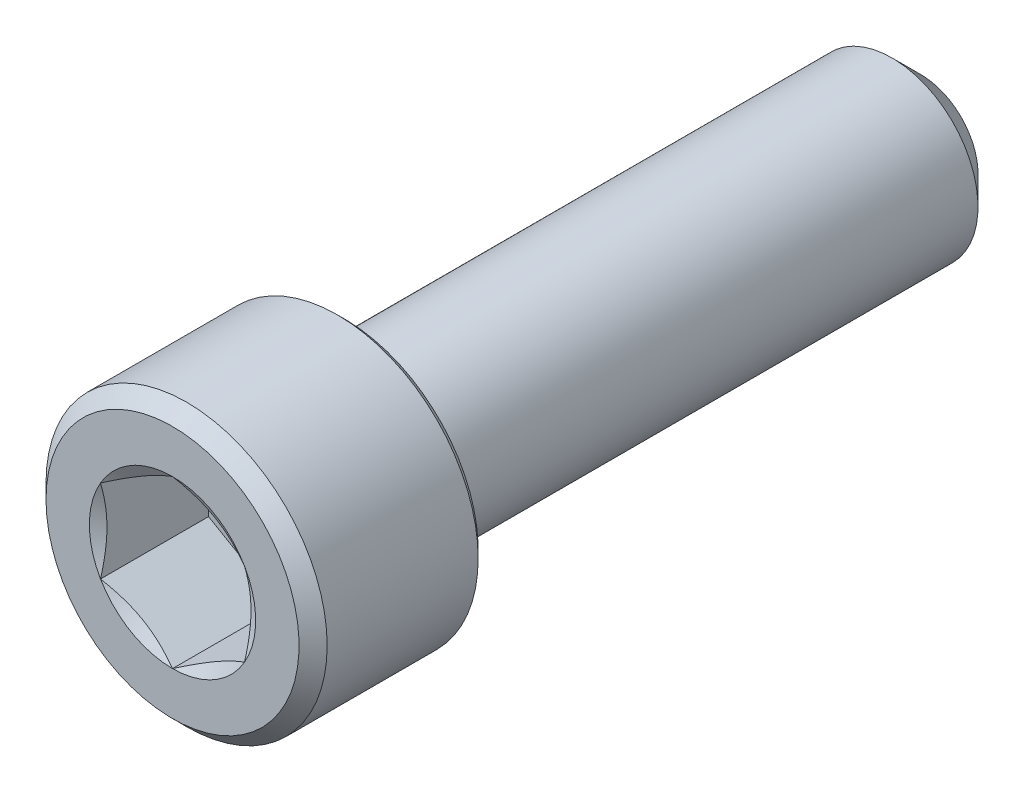
ISO-10303-21;
HEADER;
FILE_DESCRIPTION(('STEP AP214'),'2;1');
FILE_NAME('part.step','',(''),(''),'','','');
FILE_SCHEMA(('AUTOMOTIVE_DESIGN { 1 0 10303 214 1 1 1 1 }'));
ENDSEC;
DATA;
#1=APPLICATION_CONTEXT('core data for automotive mechanical design processes');
#2=APPLICATION_PROTOCOL_DEFINITION('international standard','automotive_design',2000,#1);
#3=PRODUCT_CONTEXT('',#1,'mechanical');
#4=PRODUCT('Part','Part','',(#3));
#5=PRODUCT_RELATED_PRODUCT_CATEGORY('part','',(#4));
#6=PRODUCT_DEFINITION_FORMATION('','',#4);
#7=PRODUCT_DEFINITION_CONTEXT('part definition',#1,'design');
#8=PRODUCT_DEFINITION('design','',#6,#7);
#9=PRODUCT_DEFINITION_SHAPE('','',#8);
#10=(LENGTH_UNIT() NAMED_UNIT(*) SI_UNIT(.MILLI.,.METRE.));
#11=(NAMED_UNIT(*) PLANE_ANGLE_UNIT() SI_UNIT($,.RADIAN.));
#12=(NAMED_UNIT(*) SI_UNIT($,.STERADIAN.) SOLID_ANGLE_UNIT());
#13=UNCERTAINTY_MEASURE_WITH_UNIT(LENGTH_MEASURE(1.E-05),#10,'distance_accuracy_value','');
#14=(GEOMETRIC_REPRESENTATION_CONTEXT(3) GLOBAL_UNCERTAINTY_ASSIGNED_CONTEXT((#13)) GLOBAL_UNIT_ASSIGNED_CONTEXT((#10,
#11,#12)) REPRESENTATION_CONTEXT('',''));
#15=CARTESIAN_POINT('',(0.,0.,0.));
#16=DIRECTION('',(0.,0.,1.));
#17=DIRECTION('',(1.,0.,0.));
#18=AXIS2_PLACEMENT_3D('',#15,#16,#17);
#19=CARTESIAN_POINT('',(0.,2.3241,6.1849));
#20=DIRECTION('',(0.,0.,1.));
#21=DIRECTION('',(1.,0.,0.));
#22=AXIS2_PLACEMENT_3D('',#19,#20,#21);
#23=PLANE('',#22);
#24=CARTESIAN_POINT('',(0.,0.,6.1849));
#25=DIRECTION('',(0.,0.,1.));
#26=DIRECTION('',(1.,0.,0.));
#27=AXIS2_PLACEMENT_3D('',#24,#25,#26);
#28=CIRCLE('',#27,2.09169);
#29=CARTESIAN_POINT('',(-2.09169,0.,6.1849));
#30=VERTEX_POINT('',#29);
#31=EDGE_CURVE('E169',#30,#30,#28,.T.);
#32=ORIENTED_EDGE('',*,*,#31,.T.);
#33=EDGE_LOOP('',(#32));
#34=FACE_BOUND('',#33,.T.);
#35=CARTESIAN_POINT('',(0.,0.,6.1849));
#36=DIRECTION('',(0.,0.,1.));
#37=DIRECTION('',(1.,0.,0.));
#38=AXIS2_PLACEMENT_3D('',#35,#36,#37);
#39=CIRCLE('',#38,1.3748153285078);
#40=CARTESIAN_POINT('',(1.190625,0.687407664253894,6.1849));
#41=VERTEX_POINT('',#40);
#42=CARTESIAN_POINT('',(0.,1.37481532850779,6.1849));
#43=VERTEX_POINT('',#42);
#44=EDGE_CURVE('E87',#41,#43,#39,.T.);
#45=ORIENTED_EDGE('',*,*,#44,.F.);
#46=CARTESIAN_POINT('',(1.190625,-0.6874076642539,6.1849));
#47=VERTEX_POINT('',#46);
#48=EDGE_CURVE('E47',#47,#41,#39,.T.);
#49=ORIENTED_EDGE('',*,*,#48,.F.);
#50=CARTESIAN_POINT('',(0.,-1.3748153285078,6.1849));
#51=VERTEX_POINT('',#50);
#52=EDGE_CURVE('E274',#51,#47,#39,.T.);
#53=ORIENTED_EDGE('',*,*,#52,.F.);
#54=CARTESIAN_POINT('',(-1.190625,-0.6874076642539,6.1849));
#55=VERTEX_POINT('',#54);
#56=EDGE_CURVE('E54',#55,#51,#39,.T.);
#57=ORIENTED_EDGE('',*,*,#56,.F.);
#58=CARTESIAN_POINT('',(-1.190625,0.687407664253898,6.1849));
#59=VERTEX_POINT('',#58);
#60=EDGE_CURVE('E127',#59,#55,#39,.T.);
#61=ORIENTED_EDGE('',*,*,#60,.F.);
#62=EDGE_CURVE('E96',#43,#59,#39,.T.);
#63=ORIENTED_EDGE('',*,*,#62,.F.);
#64=EDGE_LOOP('',(#45,#49,#53,#57,#61,#63));
#65=FACE_BOUND('',#64,.T.);
#66=ADVANCED_FACE('F33',(#34,#65),#23,.T.);
#67=CARTESIAN_POINT('',(0.,0.,-6.1849));
#68=DIRECTION('',(0.,0.,-1.));
#69=DIRECTION('',(-1.,0.,0.));
#70=AXIS2_PLACEMENT_3D('',#67,#68,#69);
#71=CYLINDRICAL_SURFACE('',#70,2.3241);
#72=CARTESIAN_POINT('',(0.,0.,3.456305));
#73=DIRECTION('',(0.,0.,-1.));
#74=DIRECTION('',(-1.,0.,0.));
#75=AXIS2_PLACEMENT_3D('',#72,#73,#74);
#76=CIRCLE('',#75,2.3241);
#77=CARTESIAN_POINT('',(-2.3241,0.,3.456305));
#78=VERTEX_POINT('',#77);
#79=EDGE_CURVE('E11',#78,#78,#76,.F.);
#80=CARTESIAN_POINT('',(0.,0.,5.95249));
#81=DIRECTION('',(0.,0.,1.));
#82=DIRECTION('',(1.,0.,0.));
#83=AXIS2_PLACEMENT_3D('',#80,#81,#82);
#84=CIRCLE('',#83,2.3241);
#85=CARTESIAN_POINT('',(-2.3241,0.,5.95249));
#86=VERTEX_POINT('',#85);
#87=EDGE_CURVE('E106',#86,#86,#84,.F.);
#88=CARTESIAN_POINT('',(-2.3241,0.,3.456305));
#89=CARTESIAN_POINT('',(-2.3241,0.,3.48230692708333));
#90=CARTESIAN_POINT('',(-2.3241,0.,3.50830885416667));
#91=CARTESIAN_POINT('',(-2.3241,0.,3.56031270833333));
#92=CARTESIAN_POINT('',(-2.3241,0.,3.58631463541667));
#93=CARTESIAN_POINT('',(-2.3241,0.,3.63831848958333));
#94=CARTESIAN_POINT('',(-2.3241,0.,3.66432041666667));
#95=CARTESIAN_POINT('',(-2.3241,0.,3.71632427083333));
#96=CARTESIAN_POINT('',(-2.3241,0.,3.74232619791667));
#97=CARTESIAN_POINT('',(-2.3241,0.,3.79433005208333));
#98=CARTESIAN_POINT('',(-2.3241,0.,3.82033197916667));
#99=CARTESIAN_POINT('',(-2.3241,0.,3.87233583333333));
#100=CARTESIAN_POINT('',(-2.3241,0.,3.89833776041667));
#101=CARTESIAN_POINT('',(-2.3241,0.,3.95034161458333));
#102=CARTESIAN_POINT('',(-2.3241,0.,3.97634354166667));
#103=CARTESIAN_POINT('',(-2.3241,0.,4.02834739583333));
#104=CARTESIAN_POINT('',(-2.3241,0.,4.05434932291667));
#105=CARTESIAN_POINT('',(-2.3241,0.,4.10635317708333));
#106=CARTESIAN_POINT('',(-2.3241,0.,4.13235510416667));
#107=CARTESIAN_POINT('',(-2.3241,0.,4.18435895833333));
#108=CARTESIAN_POINT('',(-2.3241,0.,4.21036088541667));
#109=CARTESIAN_POINT('',(-2.3241,0.,4.26236473958333));
#110=CARTESIAN_POINT('',(-2.3241,0.,4.28836666666667));
#111=CARTESIAN_POINT('',(-2.3241,0.,4.34037052083333));
#112=CARTESIAN_POINT('',(-2.3241,0.,4.36637244791667));
#113=CARTESIAN_POINT('',(-2.3241,0.,4.41837630208333));
#114=CARTESIAN_POINT('',(-2.3241,0.,4.44437822916667));
#115=CARTESIAN_POINT('',(-2.3241,0.,4.49638208333333));
#116=CARTESIAN_POINT('',(-2.3241,0.,4.52238401041667));
#117=CARTESIAN_POINT('',(-2.3241,0.,4.57438786458333));
#118=CARTESIAN_POINT('',(-2.3241,0.,4.60038979166667));
#119=CARTESIAN_POINT('',(-2.3241,0.,4.65239364583333));
#120=CARTESIAN_POINT('',(-2.3241,0.,4.67839557291667));
#121=CARTESIAN_POINT('',(-2.3241,0.,4.73039942708333));
#122=CARTESIAN_POINT('',(-2.3241,0.,4.75640135416667));
#123=CARTESIAN_POINT('',(-2.3241,0.,4.80840520833333));
#124=CARTESIAN_POINT('',(-2.3241,0.,4.83440713541667));
#125=CARTESIAN_POINT('',(-2.3241,0.,4.88641098958333));
#126=CARTESIAN_POINT('',(-2.3241,0.,4.91241291666667));
#127=CARTESIAN_POINT('',(-2.3241,0.,4.96441677083333));
#128=CARTESIAN_POINT('',(-2.3241,0.,4.99041869791667));
#129=CARTESIAN_POINT('',(-2.3241,0.,5.04242255208333));
#130=CARTESIAN_POINT('',(-2.3241,0.,5.06842447916667));
#131=CARTESIAN_POINT('',(-2.3241,0.,5.12042833333333));
#132=CARTESIAN_POINT('',(-2.3241,0.,5.14643026041667));
#133=CARTESIAN_POINT('',(-2.3241,0.,5.19843411458333));
#134=CARTESIAN_POINT('',(-2.3241,0.,5.22443604166667));
#135=CARTESIAN_POINT('',(-2.3241,0.,5.27643989583333));
#136=CARTESIAN_POINT('',(-2.3241,0.,5.30244182291667));
#137=CARTESIAN_POINT('',(-2.3241,0.,5.35444567708334));
#138=CARTESIAN_POINT('',(-2.3241,0.,5.38044760416667));
#139=CARTESIAN_POINT('',(-2.3241,0.,5.43245145833333));
#140=CARTESIAN_POINT('',(-2.3241,0.,5.45845338541667));
#141=CARTESIAN_POINT('',(-2.3241,0.,5.51045723958334));
#142=CARTESIAN_POINT('',(-2.3241,0.,5.53645916666667));
#143=CARTESIAN_POINT('',(-2.3241,0.,5.58846302083334));
#144=CARTESIAN_POINT('',(-2.3241,0.,5.61446494791667));
#145=CARTESIAN_POINT('',(-2.3241,0.,5.66646880208333));
#146=CARTESIAN_POINT('',(-2.3241,0.,5.69247072916667));
#147=CARTESIAN_POINT('',(-2.3241,0.,5.74447458333333));
#148=CARTESIAN_POINT('',(-2.3241,0.,5.77047651041667));
#149=CARTESIAN_POINT('',(-2.3241,0.,5.82248036458334));
#150=CARTESIAN_POINT('',(-2.3241,0.,5.84848229166667));
#151=CARTESIAN_POINT('',(-2.3241,0.,5.90048614583333));
#152=CARTESIAN_POINT('',(-2.3241,0.,5.92648807291667));
#153=CARTESIAN_POINT('',(-2.3241,0.,5.95249));
#154=B_SPLINE_CURVE_WITH_KNOTS('',3,(#88,#89,#90,#91,#92,#93,#94,#95,#96,#97,#98,#99,#100,#101,
#102,#103,#104,#105,#106,#107,#108,#109,#110,#111,#112,#113,#114,#115,#116,#117,#118,#119,#120,
#121,#122,#123,#124,#125,#126,#127,#128,#129,#130,#131,#132,#133,#134,#135,#136,#137,#138,#139,
#140,#141,#142,#143,#144,#145,#146,#147,#148,#149,#150,#151,#152,#153),.UNSPECIFIED.,.F.,.F.,(4,
2,2,2,2,2,2,2,2,2,2,2,2,2,2,2,2,2,2,2,2,2,2,2,2,2,2,2,2,2,2,2,4),(0.,0.0780057812499995,
0.156011562500001,0.23401734375,0.312023125,0.390028906250001,0.4680346875,0.54604046875,
0.624046249999999,0.702052031250001,0.7800578125,0.85806359375,0.936069375000001,1.01407515625,
1.0920809375,1.17008671875,1.2480925,1.32609828125,1.4041040625,1.48210984375,1.560115625,
1.63812140625,1.7161271875,1.79413296875,1.87213875,1.95014453125,2.0281503125,2.10615609375,
2.184161875,2.26216765625,2.3401734375,2.41817921875,2.496185),.UNSPECIFIED.);
#155=EDGE_CURVE('BSEAM186',#78,#86,#154,.T.);
#156=ORIENTED_EDGE('',*,*,#79,.T.);
#157=ORIENTED_EDGE('',*,*,#87,.T.);
#158=ORIENTED_EDGE('',*,*,#155,.T.);
#159=ORIENTED_EDGE('',*,*,#155,.F.);
#160=EDGE_LOOP('',(#156,#158,#157,#159));
#161=FACE_BOUND('',#160,.T.);
#162=ADVANCED_FACE('F186',(#161),#71,.T.);
#163=CARTESIAN_POINT('',(0.,2.3241,3.3401));
#164=DIRECTION('',(0.,0.,-1.));
#165=DIRECTION('',(-1.,0.,0.));
#166=AXIS2_PLACEMENT_3D('',#163,#164,#165);
#167=PLANE('',#166);
#168=CARTESIAN_POINT('',(0.,0.,3.3401));
#169=DIRECTION('',(0.,0.,-1.));
#170=DIRECTION('',(-1.,0.,0.));
#171=AXIS2_PLACEMENT_3D('',#168,#169,#170);
#172=CIRCLE('',#171,2.207895);
#173=CARTESIAN_POINT('',(-2.207895,0.,3.3401));
#174=VERTEX_POINT('',#173);
#175=EDGE_CURVE('E41',#174,#174,#172,.T.);
#176=ORIENTED_EDGE('',*,*,#175,.T.);
#177=EDGE_LOOP('',(#176));
#178=FACE_BOUND('',#177,.T.);
#179=CARTESIAN_POINT('',(0.,0.,3.3401));
#180=DIRECTION('',(0.,0.,-1.));
#181=DIRECTION('',(-1.,0.,0.));
#182=AXIS2_PLACEMENT_3D('',#179,#180,#181);
#183=CIRCLE('',#182,1.4224);
#184=CARTESIAN_POINT('',(-1.4224,0.,3.3401));
#185=VERTEX_POINT('',#184);
#186=EDGE_CURVE('E107',#185,#185,#183,.T.);
#187=ORIENTED_EDGE('',*,*,#186,.F.);
#188=EDGE_LOOP('',(#187));
#189=FACE_BOUND('',#188,.T.);
#190=ADVANCED_FACE('F174',(#178,#189),#167,.T.);
#191=CARTESIAN_POINT('',(0.,0.,-6.1849));
#192=DIRECTION('',(0.,0.,-1.));
#193=DIRECTION('',(-1.,0.,0.));
#194=AXIS2_PLACEMENT_3D('',#191,#192,#193);
#195=CYLINDRICAL_SURFACE('',#194,1.4224);
#196=ORIENTED_EDGE('',*,*,#186,.T.);
#197=EDGE_LOOP('',(#196));
#198=FACE_BOUND('',#197,.T.);
#199=CARTESIAN_POINT('',(0.,0.,-5.70865));
#200=DIRECTION('',(0.,0.,-1.));
#201=DIRECTION('',(-1.,0.,0.));
#202=AXIS2_PLACEMENT_3D('',#199,#200,#201);
#203=CIRCLE('',#202,1.4224);
#204=CARTESIAN_POINT('',(-1.4224,0.,-5.70865));
#205=VERTEX_POINT('',#204);
#206=EDGE_CURVE('E215',#205,#205,#203,.T.);
#207=ORIENTED_EDGE('',*,*,#206,.F.);
#208=EDGE_LOOP('',(#207));
#209=FACE_BOUND('',#208,.T.);
#210=ADVANCED_FACE('F197',(#198,#209),#195,.T.);
#211=CARTESIAN_POINT('',(0.,0.,-6.1849));
#212=DIRECTION('',(0.,0.,1.));
#213=DIRECTION('',(1.,0.,0.));
#214=AXIS2_PLACEMENT_3D('',#211,#212,#213);
#215=CONICAL_SURFACE('',#214,0.94615,0.785398163397443);
#216=ORIENTED_EDGE('',*,*,#206,.T.);
#217=EDGE_LOOP('',(#216));
#218=FACE_BOUND('',#217,.T.);
#219=CARTESIAN_POINT('',(0.,0.,-6.1849));
#220=DIRECTION('',(0.,0.,-1.));
#221=DIRECTION('',(-1.,0.,0.));
#222=AXIS2_PLACEMENT_3D('',#219,#220,#221);
#223=CIRCLE('',#222,0.94615);
#224=CARTESIAN_POINT('',(-0.94615,0.,-6.1849));
#225=VERTEX_POINT('',#224);
#226=EDGE_CURVE('E213',#225,#225,#223,.T.);
#227=ORIENTED_EDGE('',*,*,#226,.F.);
#228=EDGE_LOOP('',(#227));
#229=FACE_BOUND('',#228,.T.);
#230=ADVANCED_FACE('F200',(#218,#229),#215,.T.);
#231=CARTESIAN_POINT('',(0.,0.946149999999999,-6.1849));
#232=DIRECTION('',(0.,0.,-1.));
#233=DIRECTION('',(-1.,0.,0.));
#234=AXIS2_PLACEMENT_3D('',#231,#232,#233);
#235=PLANE('',#234);
#236=ORIENTED_EDGE('',*,*,#226,.T.);
#237=EDGE_LOOP('',(#236));
#238=FACE_BOUND('',#237,.T.);
#239=ADVANCED_FACE('F203',(#238),#235,.T.);
#240=CARTESIAN_POINT('',(0.,0.,6.1849));
#241=DIRECTION('',(0.,0.,1.));
#242=DIRECTION('',(1.,0.,0.));
#243=AXIS2_PLACEMENT_3D('',#240,#241,#242);
#244=CONICAL_SURFACE('',#243,1.3748153285078,1.0471975511966);
#245=ORIENTED_EDGE('',*,*,#62,.T.);
#246=CARTESIAN_POINT('',(0.000199999999999628,1.37493079856163,6.18496667506491));
#247=CARTESIAN_POINT('',(-0.0521241335920581,1.34472144594714,6.16751589117194));
#248=CARTESIAN_POINT('',(-0.10489992088635,1.31425133094609,6.15164448025971));
#249=CARTESIAN_POINT('',(-0.211365548014193,1.25278337246439,6.12393948973927));
#250=CARTESIAN_POINT('',(-0.265057280958371,1.22178443599581,6.11211571335686));
#251=CARTESIAN_POINT('',(-0.371775270715524,1.16017077588214,6.09370852677656));
#252=CARTESIAN_POINT('',(-0.424785098452946,1.12956553756824,6.08700263679728));
#253=CARTESIAN_POINT('',(-0.5310544492546,1.0682108992763,6.07899416085589));
#254=CARTESIAN_POINT('',(-0.584313585518837,1.03746172261734,6.07768494640033));
#255=CARTESIAN_POINT('',(-0.683848928687893,0.979994965444803,6.08039449461824));
#256=CARTESIAN_POINT('',(-0.73013996249378,0.953268824615908,6.08374796705388));
#257=CARTESIAN_POINT('',(-0.82242041432083,0.89999068091262,6.0943808803557));
#258=CARTESIAN_POINT('',(-0.868409512663249,0.873438862604836,6.10166396076476));
#259=CARTESIAN_POINT('',(-0.960880551590551,0.820050683387914,6.11987281906172));
#260=CARTESIAN_POINT('',(-1.00735077599472,0.793221086818868,6.13087585831938));
#261=CARTESIAN_POINT('',(-1.09959774541686,0.739962274191063,6.15584909077667));
#262=CARTESIAN_POINT('',(-1.14537567417661,0.713532374698679,6.16981340816491));
#263=CARTESIAN_POINT('',(-1.190825,0.687292194200058,6.18496667506491));
#264=B_SPLINE_CURVE_WITH_KNOTS('',3,(#246,#247,#248,#249,#250,#251,#252,#253,#254,#255,#256,
#257,#258,#259,#260,#261,#262,#263),.UNSPECIFIED.,.F.,.F.,(4,2,2,2,2,2,2,2,4),(0.,
0.188739408275265,0.37793275505226,0.562442610563906,0.746725773280445,0.907244981861693,
1.06791311672804,1.23214725548008,1.39605851764637),.UNSPECIFIED.);
#265=EDGE_CURVE('E101',#43,#59,#264,.T.);
#266=ORIENTED_EDGE('',*,*,#265,.F.);
#267=EDGE_LOOP('',(#245,#266));
#268=FACE_BOUND('',#267,.T.);
#269=ADVANCED_FACE('F102',(#268),#244,.F.);
#270=ORIENTED_EDGE('',*,*,#60,.T.);
#271=CARTESIAN_POINT('',(-1.190625,-1.78015716020704,6.62761639065543));
#272=CARTESIAN_POINT('',(-1.190625,-1.72874189185983,6.6029488309547));
#273=CARTESIAN_POINT('',(-1.190625,-1.67720133899231,6.57853815850608));
#274=CARTESIAN_POINT('',(-1.190625,-1.57380296646994,6.53037458331367));
#275=CARTESIAN_POINT('',(-1.190625,-1.52194509174156,6.50662179894601));
#276=CARTESIAN_POINT('',(-1.190625,-1.41754804002315,6.45978529493314));
#277=CARTESIAN_POINT('',(-1.190625,-1.36500663843256,6.43670650788437));
#278=CARTESIAN_POINT('',(-1.190625,-1.25948270070629,6.39158924420431));
#279=CARTESIAN_POINT('',(-1.190625,-1.2065001876767,6.36955071348109));
#280=CARTESIAN_POINT('',(-1.190625,-1.04398470146779,6.30425143698334));
#281=CARTESIAN_POINT('',(-1.190625,-0.933604354597388,6.26305859990033));
#282=CARTESIAN_POINT('',(-1.190625,-0.710006074690725,6.18975095661509));
#283=CARTESIAN_POINT('',(-1.190625,-0.596796359427707,6.15761258233276));
#284=CARTESIAN_POINT('',(-1.190625,-0.424696051876905,6.12033918761179));
#285=CARTESIAN_POINT('',(-1.190625,-0.367003246478024,6.10974189188063));
#286=CARTESIAN_POINT('',(-1.190625,-0.250970459440642,6.09291523013128));
#287=CARTESIAN_POINT('',(-1.190625,-0.19263052180734,6.08668556893984));
#288=CARTESIAN_POINT('',(-1.190625,-0.076326292549454,6.07917128602073));
#289=CARTESIAN_POINT('',(-1.190625,-0.0183658752538255,6.07782830931197));
#290=CARTESIAN_POINT('',(-1.190625,0.097459106292916,6.0800451833237));
#291=CARTESIAN_POINT('',(-1.190625,0.155323664386656,6.08360533762896));
#292=CARTESIAN_POINT('',(-1.190625,0.298095905598658,6.0981253650142));
#293=CARTESIAN_POINT('',(-1.190625,0.382726930762756,6.11180633734599));
#294=CARTESIAN_POINT('',(-1.190625,0.550343213783401,6.14708560832923));
#295=CARTESIAN_POINT('',(-1.190625,0.633326360497143,6.1686934492585));
#296=CARTESIAN_POINT('',(-1.190625,0.757436785616908,6.20560492392695));
#297=CARTESIAN_POINT('',(-1.190625,0.799205603652767,6.21883085473874));
#298=CARTESIAN_POINT('',(-1.190625,0.882308453068413,6.24650619055065));
#299=CARTESIAN_POINT('',(-1.190625,0.923642737930444,6.2609548320084));
#300=CARTESIAN_POINT('',(-1.190625,1.00593175891306,6.29086575253452));
#301=CARTESIAN_POINT('',(-1.190625,1.04688656247483,6.30632784739001));
#302=CARTESIAN_POINT('',(-1.190625,1.12847345966588,6.33809842729247));
#303=CARTESIAN_POINT('',(-1.190625,1.1691054974264,6.35440705534033));
#304=CARTESIAN_POINT('',(-1.190625,1.27282063071651,6.39708027306631));
#305=CARTESIAN_POINT('',(-1.190625,1.33569634158371,6.42394836206802));
#306=CARTESIAN_POINT('',(-1.190625,1.46087997208419,6.47897974000246));
#307=CARTESIAN_POINT('',(-1.190625,1.52318784876136,6.50714312596451));
#308=CARTESIAN_POINT('',(-1.190625,1.70944892885062,6.59311962148726));
#309=CARTESIAN_POINT('',(-1.190625,1.83271877672913,6.65241025432627));
#310=CARTESIAN_POINT('',(-1.190625,2.07820533773844,6.77347815906779));
#311=CARTESIAN_POINT('',(-1.190625,2.20042056990702,6.83525839830213));
#312=CARTESIAN_POINT('',(-1.190625,2.44401368474694,6.96040744447874));
#313=CARTESIAN_POINT('',(-1.190625,2.56539167137774,7.02377604949749));
#314=CARTESIAN_POINT('',(-1.190625,2.79613899431498,7.14557472773289));
#315=CARTESIAN_POINT('',(-1.190625,2.90556045463821,7.20390639474909));
#316=CARTESIAN_POINT('',(-1.190625,3.12405139947394,7.32123435677135));
#317=CARTESIAN_POINT('',(-1.190625,3.23312087076723,7.3802306763737));
#318=CARTESIAN_POINT('',(-1.190625,3.45071155612091,7.49857057406643));
#319=CARTESIAN_POINT('',(-1.190625,3.55923345906017,7.55791288721241));
#320=CARTESIAN_POINT('',(-1.190625,3.77605786024419,7.67698374464986));
#321=CARTESIAN_POINT('',(-1.190625,3.88436036967376,7.73671226856633));
#322=CARTESIAN_POINT('',(-1.190625,3.99258405604318,7.79658241678741));
#323=B_SPLINE_CURVE_WITH_KNOTS('',3,(#271,#272,#273,#274,#275,#276,#277,#278,#279,#280,#281,
#282,#283,#284,#285,#286,#287,#288,#289,#290,#291,#292,#293,#294,#295,#296,#297,#298,#299,#300,
#301,#302,#303,#304,#305,#306,#307,#308,#309,#310,#311,#312,#313,#314,#315,#316,#317,#318,#319,
#320,#321,#322),.UNSPECIFIED.,.F.,.F.,(4,2,2,2,2,2,2,2,2,2,2,2,2,2,2,2,2,2,2,2,2,2,2,2,2,4),(0.,
0.171081312800698,0.342193211477217,0.514343080996252,0.686483989069504,1.03974142261425,
1.39207067467284,1.56790731618694,1.7437320731725,1.91745017490203,2.09117903313408,
2.34784044559531,2.60481184357443,2.73623569960086,2.86757808297636,2.99889665842932,
3.13023748956819,3.33534372136274,3.54046534255141,3.95077633549906,4.36159174218368,
4.7723551855675,5.14434822317799,5.51635507236915,5.8874157094349,6.25845692794643),.UNSPECIFIED.);
#324=EDGE_CURVE('E95',#59,#55,#323,.F.);
#325=ORIENTED_EDGE('',*,*,#324,.F.);
#326=EDGE_LOOP('',(#270,#325));
#327=FACE_BOUND('',#326,.T.);
#328=ADVANCED_FACE('F210',(#327),#244,.F.);
#329=ORIENTED_EDGE('',*,*,#56,.T.);
#330=CARTESIAN_POINT('',(-1.190825,-0.687292194200062,6.18496667506491));
#331=CARTESIAN_POINT('',(-1.13850086640794,-0.717501546814551,6.16751589117194));
#332=CARTESIAN_POINT('',(-1.08572507911365,-0.747971661815605,6.15164448025971));
#333=CARTESIAN_POINT('',(-0.979259451985808,-0.809439620297307,6.12393948973927));
#334=CARTESIAN_POINT('',(-0.925567719041629,-0.840438556765885,6.11211571335686));
#335=CARTESIAN_POINT('',(-0.818849729284477,-0.902052216879553,6.09370852677656));
#336=CARTESIAN_POINT('',(-0.765839901547055,-0.932657455193449,6.08700263679728));
#337=CARTESIAN_POINT('',(-0.659570550745402,-0.994012093485391,6.07899416085589));
#338=CARTESIAN_POINT('',(-0.606311414481165,-1.02476127014435,6.07768494640033));
#339=CARTESIAN_POINT('',(-0.506776071312108,-1.08222802731689,6.08039449461824));
#340=CARTESIAN_POINT('',(-0.460485037506222,-1.10895416814579,6.08374796705388));
#341=CARTESIAN_POINT('',(-0.368204585679171,-1.16223231184907,6.0943808803557));
#342=CARTESIAN_POINT('',(-0.322215487336752,-1.18878413015686,6.10166396076476));
#343=CARTESIAN_POINT('',(-0.22974444840945,-1.24217230937378,6.11987281906171));
#344=CARTESIAN_POINT('',(-0.183274224005285,-1.26900190594283,6.13087585831937));
#345=CARTESIAN_POINT('',(-0.0910272545831361,-1.32226071857063,6.15584909077667));
#346=CARTESIAN_POINT('',(-0.0452493258233878,-1.34869061806302,6.16981340816491));
#347=CARTESIAN_POINT('',(0.00020000000000012,-1.37493079856164,6.18496667506491));
#348=B_SPLINE_CURVE_WITH_KNOTS('',3,(#330,#331,#332,#333,#334,#335,#336,#337,#338,#339,#340,
#341,#342,#343,#344,#345,#346,#347),.UNSPECIFIED.,.F.,.F.,(4,2,2,2,2,2,2,2,4),(0.,
0.188739408275265,0.377932755052259,0.562442610563904,0.746725773280443,0.907244981861691,
1.06791311672804,1.23214725548008,1.39605851764637),.UNSPECIFIED.);
#349=EDGE_CURVE('E137',#55,#51,#348,.T.);
#350=ORIENTED_EDGE('',*,*,#349,.F.);
#351=EDGE_LOOP('',(#329,#350));
#352=FACE_BOUND('',#351,.T.);
#353=ADVANCED_FACE('F277',(#352),#244,.F.);
#354=ORIENTED_EDGE('',*,*,#52,.T.);
#355=CARTESIAN_POINT('',(-0.000199999999999766,-1.37493079856164,6.18496667506491));
#356=CARTESIAN_POINT('',(0.0521241335920579,-1.34472144594715,6.16751589117194));
#357=CARTESIAN_POINT('',(0.10489992088635,-1.31425133094609,6.15164448025971));
#358=CARTESIAN_POINT('',(0.211365548014192,-1.25278337246439,6.12393948973927));
#359=CARTESIAN_POINT('',(0.265057280958371,-1.22178443599581,6.11211571335686));
#360=CARTESIAN_POINT('',(0.371775270715523,-1.16017077588214,6.09370852677656));
#361=CARTESIAN_POINT('',(0.424785098452945,-1.12956553756825,6.08700263679728));
#362=CARTESIAN_POINT('',(0.531054449254598,-1.06821089927631,6.07899416085589));
#363=CARTESIAN_POINT('',(0.584313585518835,-1.03746172261734,6.07768494640033));
#364=CARTESIAN_POINT('',(0.683848928687891,-0.979994965444807,6.08039449461824));
#365=CARTESIAN_POINT('',(0.730139962493778,-0.953268824615912,6.08374796705388));
#366=CARTESIAN_POINT('',(0.822420414320829,-0.899990680912624,6.0943808803557));
#367=CARTESIAN_POINT('',(0.868409512663248,-0.87343886260484,6.10166396076476));
#368=CARTESIAN_POINT('',(0.96088055159055,-0.820050683387918,6.11987281906172));
#369=CARTESIAN_POINT('',(1.00735077599471,-0.793221086818871,6.13087585831938));
#370=CARTESIAN_POINT('',(1.09959774541686,-0.739962274191066,6.15584909077667));
#371=CARTESIAN_POINT('',(1.14537567417661,-0.713532374698682,6.16981340816491));
#372=CARTESIAN_POINT('',(1.190825,-0.687292194200062,6.18496667506491));
#373=B_SPLINE_CURVE_WITH_KNOTS('',3,(#355,#356,#357,#358,#359,#360,#361,#362,#363,#364,#365,
#366,#367,#368,#369,#370,#371,#372),.UNSPECIFIED.,.F.,.F.,(4,2,2,2,2,2,2,2,4),(0.,
0.188739408275265,0.377932755052259,0.562442610563904,0.746725773280443,0.907244981861691,
1.06791311672804,1.23214725548008,1.39605851764637),.UNSPECIFIED.);
#374=EDGE_CURVE('E251',#51,#47,#373,.T.);
#375=ORIENTED_EDGE('',*,*,#374,.F.);
#376=EDGE_LOOP('',(#354,#375));
#377=FACE_BOUND('',#376,.T.);
#378=ADVANCED_FACE('F276',(#377),#244,.F.);
#379=ORIENTED_EDGE('',*,*,#48,.T.);
#380=CARTESIAN_POINT('',(1.190625,-1.78015716020704,6.62761639065543));
#381=CARTESIAN_POINT('',(1.190625,-1.72874189185983,6.6029488309547));
#382=CARTESIAN_POINT('',(1.190625,-1.67720133899231,6.57853815850608));
#383=CARTESIAN_POINT('',(1.190625,-1.57380296646994,6.53037458331367));
#384=CARTESIAN_POINT('',(1.190625,-1.52194509174156,6.50662179894601));
#385=CARTESIAN_POINT('',(1.190625,-1.41754804002315,6.45978529493314));
#386=CARTESIAN_POINT('',(1.190625,-1.36500663843256,6.43670650788437));
#387=CARTESIAN_POINT('',(1.190625,-1.25948270070629,6.39158924420431));
#388=CARTESIAN_POINT('',(1.190625,-1.2065001876767,6.36955071348109));
#389=CARTESIAN_POINT('',(1.190625,-1.04398470146779,6.30425143698334));
#390=CARTESIAN_POINT('',(1.190625,-0.933604354597387,6.26305859990033));
#391=CARTESIAN_POINT('',(1.190625,-0.710006074690725,6.18975095661509));
#392=CARTESIAN_POINT('',(1.190625,-0.596796359427706,6.15761258233276));
#393=CARTESIAN_POINT('',(1.190625,-0.424696051876905,6.12033918761179));
#394=CARTESIAN_POINT('',(1.190625,-0.367003246478024,6.10974189188064));
#395=CARTESIAN_POINT('',(1.190625,-0.250970459440642,6.09291523013128));
#396=CARTESIAN_POINT('',(1.190625,-0.19263052180734,6.08668556893984));
#397=CARTESIAN_POINT('',(1.190625,-0.0763262925494536,6.07917128602073));
#398=CARTESIAN_POINT('',(1.190625,-0.018365875253825,6.07782830931197));
#399=CARTESIAN_POINT('',(1.190625,0.0974591062929166,6.0800451833237));
#400=CARTESIAN_POINT('',(1.190625,0.155323664386656,6.08360533762896));
#401=CARTESIAN_POINT('',(1.190625,0.298095905598659,6.0981253650142));
#402=CARTESIAN_POINT('',(1.190625,0.382726930762757,6.11180633734599));
#403=CARTESIAN_POINT('',(1.190625,0.550343213783401,6.14708560832923));
#404=CARTESIAN_POINT('',(1.190625,0.633326360497144,6.1686934492585));
#405=CARTESIAN_POINT('',(1.190625,0.757436785616909,6.20560492392695));
#406=CARTESIAN_POINT('',(1.190625,0.799205603652768,6.21883085473874));
#407=CARTESIAN_POINT('',(1.190625,0.882308453068414,6.24650619055065));
#408=CARTESIAN_POINT('',(1.190625,0.923642737930444,6.2609548320084));
#409=CARTESIAN_POINT('',(1.190625,1.00593175891306,6.29086575253452));
#410=CARTESIAN_POINT('',(1.190625,1.04688656247483,6.30632784739001));
#411=CARTESIAN_POINT('',(1.190625,1.12847345966589,6.33809842729247));
#412=CARTESIAN_POINT('',(1.190625,1.1691054974264,6.35440705534033));
#413=CARTESIAN_POINT('',(1.190625,1.27282063071651,6.39708027306631));
#414=CARTESIAN_POINT('',(1.190625,1.33569634158371,6.42394836206802));
#415=CARTESIAN_POINT('',(1.190625,1.46087997208419,6.47897974000246));
#416=CARTESIAN_POINT('',(1.190625,1.52318784876136,6.50714312596451));
#417=CARTESIAN_POINT('',(1.190625,1.70944892885062,6.59311962148726));
#418=CARTESIAN_POINT('',(1.190625,1.83271877672913,6.65241025432627));
#419=CARTESIAN_POINT('',(1.190625,2.07820533773844,6.77347815906779));
#420=CARTESIAN_POINT('',(1.190625,2.20042056990702,6.83525839830213));
#421=CARTESIAN_POINT('',(1.190625,2.44401368474694,6.96040744447874));
#422=CARTESIAN_POINT('',(1.190625,2.56539167137774,7.02377604949749));
#423=CARTESIAN_POINT('',(1.190625,2.79613899431499,7.14557472773289));
#424=CARTESIAN_POINT('',(1.190625,2.90556045463821,7.20390639474909));
#425=CARTESIAN_POINT('',(1.190625,3.12405139947394,7.32123435677135));
#426=CARTESIAN_POINT('',(1.190625,3.23312087076723,7.3802306763737));
#427=CARTESIAN_POINT('',(1.190625,3.45071155612091,7.49857057406643));
#428=CARTESIAN_POINT('',(1.190625,3.55923345906017,7.55791288721241));
#429=CARTESIAN_POINT('',(1.190625,3.77605786024419,7.67698374464985));
#430=CARTESIAN_POINT('',(1.190625,3.88436036967376,7.73671226856633));
#431=CARTESIAN_POINT('',(1.190625,3.99258405604319,7.79658241678741));
#432=B_SPLINE_CURVE_WITH_KNOTS('',3,(#380,#381,#382,#383,#384,#385,#386,#387,#388,#389,#390,
#391,#392,#393,#394,#395,#396,#397,#398,#399,#400,#401,#402,#403,#404,#405,#406,#407,#408,#409,
#410,#411,#412,#413,#414,#415,#416,#417,#418,#419,#420,#421,#422,#423,#424,#425,#426,#427,#428,
#429,#430,#431),.UNSPECIFIED.,.F.,.F.,(4,2,2,2,2,2,2,2,2,2,2,2,2,2,2,2,2,2,2,2,2,2,2,2,2,4),(0.,
0.171081312800697,0.342193211477216,0.514343080996251,0.686483989069503,1.03974142261425,
1.39207067467283,1.56790731618694,1.7437320731725,1.91745017490203,2.09117903313408,
2.34784044559531,2.60481184357443,2.73623569960086,2.86757808297636,2.99889665842932,
3.13023748956819,3.33534372136274,3.5404653425514,3.95077633549906,4.36159174218368,
4.7723551855675,5.14434822317799,5.51635507236915,5.8874157094349,6.25845692794643),.UNSPECIFIED.);
#433=EDGE_CURVE('E117',#47,#41,#432,.T.);
#434=ORIENTED_EDGE('',*,*,#433,.F.);
#435=EDGE_LOOP('',(#379,#434));
#436=FACE_BOUND('',#435,.T.);
#437=ADVANCED_FACE('F287',(#436),#244,.F.);
#438=ORIENTED_EDGE('',*,*,#44,.T.);
#439=CARTESIAN_POINT('',(1.190825,0.687292194200059,6.18496667506491));
#440=CARTESIAN_POINT('',(1.13850086640794,0.717501546814547,6.16751589117194));
#441=CARTESIAN_POINT('',(1.08572507911365,0.747971661815602,6.15164448025971));
#442=CARTESIAN_POINT('',(0.979259451985808,0.809439620297304,6.12393948973927));
#443=CARTESIAN_POINT('',(0.925567719041629,0.840438556765883,6.11211571335686));
#444=CARTESIAN_POINT('',(0.818849729284477,0.90205221687955,6.09370852677656));
#445=CARTESIAN_POINT('',(0.765839901547055,0.932657455193447,6.08700263679728));
#446=CARTESIAN_POINT('',(0.659570550745401,0.994012093485388,6.07899416085589));
#447=CARTESIAN_POINT('',(0.606311414481164,1.02476127014435,6.07768494640033));
#448=CARTESIAN_POINT('',(0.506776071312108,1.08222802731689,6.08039449461824));
#449=CARTESIAN_POINT('',(0.460485037506222,1.10895416814578,6.08374796705388));
#450=CARTESIAN_POINT('',(0.368204585679171,1.16223231184907,6.0943808803557));
#451=CARTESIAN_POINT('',(0.322215487336752,1.18878413015685,6.10166396076476));
#452=CARTESIAN_POINT('',(0.22974444840945,1.24217230937378,6.11987281906172));
#453=CARTESIAN_POINT('',(0.183274224005285,1.26900190594282,6.13087585831938));
#454=CARTESIAN_POINT('',(0.0910272545831359,1.32226071857063,6.15584909077667));
#455=CARTESIAN_POINT('',(0.0452493258233876,1.34869061806301,6.16981340816491));
#456=CARTESIAN_POINT('',(-0.00020000000000037,1.37493079856163,6.18496667506491));
#457=B_SPLINE_CURVE_WITH_KNOTS('',3,(#439,#440,#441,#442,#443,#444,#445,#446,#447,#448,#449,
#450,#451,#452,#453,#454,#455,#456),.UNSPECIFIED.,.F.,.F.,(4,2,2,2,2,2,2,2,4),(0.,
0.188739408275265,0.377932755052259,0.562442610563905,0.746725773280444,0.907244981861692,
1.06791311672804,1.23214725548008,1.39605851764637),.UNSPECIFIED.);
#458=EDGE_CURVE('E91',#41,#43,#457,.T.);
#459=ORIENTED_EDGE('',*,*,#458,.F.);
#460=EDGE_LOOP('',(#438,#459));
#461=FACE_BOUND('',#460,.T.);
#462=ADVANCED_FACE('F89',(#461),#244,.F.);
#463=CARTESIAN_POINT('',(0.,0.,4.3989625));
#464=DIRECTION('',(0.,0.,1.));
#465=DIRECTION('',(1.,0.,0.));
#466=AXIS2_PLACEMENT_3D('',#463,#464,#465);
#467=PLANE('',#466);
#468=DIRECTION('',(-0.866025403784439,0.5,0.));
#469=VECTOR('',#468,1.);
#470=CARTESIAN_POINT('',(1.190625,0.687407664253897,4.3989625));
#471=LINE('',#470,#469);
#472=CARTESIAN_POINT('',(1.190625,0.687407664253897,4.3989625));
#473=VERTEX_POINT('',#472);
#474=CARTESIAN_POINT('',(0.,1.37481532850779,4.3989625));
#475=VERTEX_POINT('',#474);
#476=EDGE_CURVE('E116',#473,#475,#471,.T.);
#477=ORIENTED_EDGE('',*,*,#476,.T.);
#478=DIRECTION('',(-0.866025403784438,-0.5,0.));
#479=VECTOR('',#478,1.);
#480=CARTESIAN_POINT('',(0.,1.37481532850779,4.3989625));
#481=LINE('',#480,#479);
#482=CARTESIAN_POINT('',(-1.190625,0.687407664253896,4.3989625));
#483=VERTEX_POINT('',#482);
#484=EDGE_CURVE('E121',#475,#483,#481,.T.);
#485=ORIENTED_EDGE('',*,*,#484,.T.);
#486=DIRECTION('',(0.,-1.,0.));
#487=VECTOR('',#486,1.);
#488=CARTESIAN_POINT('',(-1.190625,0.687407664253896,4.3989625));
#489=LINE('',#488,#487);
#490=CARTESIAN_POINT('',(-1.190625,-0.6874076642539,4.3989625));
#491=VERTEX_POINT('',#490);
#492=EDGE_CURVE('E237',#483,#491,#489,.T.);
#493=ORIENTED_EDGE('',*,*,#492,.T.);
#494=DIRECTION('',(0.866025403784439,-0.5,0.));
#495=VECTOR('',#494,1.);
#496=CARTESIAN_POINT('',(-1.190625,-0.6874076642539,4.3989625));
#497=LINE('',#496,#495);
#498=CARTESIAN_POINT('',(0.,-1.3748153285078,4.3989625));
#499=VERTEX_POINT('',#498);
#500=EDGE_CURVE('E234',#491,#499,#497,.T.);
#501=ORIENTED_EDGE('',*,*,#500,.T.);
#502=DIRECTION('',(0.866025403784439,0.5,0.));
#503=VECTOR('',#502,1.);
#504=CARTESIAN_POINT('',(0.,-1.3748153285078,4.3989625));
#505=LINE('',#504,#503);
#506=CARTESIAN_POINT('',(1.190625,-0.6874076642539,4.3989625));
#507=VERTEX_POINT('',#506);
#508=EDGE_CURVE('E231',#499,#507,#505,.T.);
#509=ORIENTED_EDGE('',*,*,#508,.T.);
#510=DIRECTION('',(0.,1.,0.));
#511=VECTOR('',#510,1.);
#512=CARTESIAN_POINT('',(1.190625,-0.6874076642539,4.3989625));
#513=LINE('',#512,#511);
#514=EDGE_CURVE('E124',#507,#473,#513,.T.);
#515=ORIENTED_EDGE('',*,*,#514,.T.);
#516=EDGE_LOOP('',(#477,#485,#493,#501,#509,#515));
#517=FACE_BOUND('',#516,.T.);
#518=ADVANCED_FACE('F157',(#517),#467,.T.);
#519=CARTESIAN_POINT('',(0.,1.37481532850779,4.3989625));
#520=DIRECTION('',(-0.5,0.866025403784438,0.));
#521=DIRECTION('',(-0.866025403784439,-0.5,0.));
#522=AXIS2_PLACEMENT_3D('',#519,#520,#521);
#523=PLANE('',#522);
#524=DIRECTION('',(0.,0.,1.));
#525=VECTOR('',#524,1.);
#526=CARTESIAN_POINT('',(0.,1.37481532850779,4.3989625));
#527=LINE('',#526,#525);
#528=EDGE_CURVE('E113',#475,#43,#527,.T.);
#529=ORIENTED_EDGE('',*,*,#528,.T.);
#530=ORIENTED_EDGE('',*,*,#265,.T.);
#531=DIRECTION('',(0.,0.,1.));
#532=VECTOR('',#531,1.);
#533=CARTESIAN_POINT('',(-1.190625,0.687407664253896,4.3989625));
#534=LINE('',#533,#532);
#535=EDGE_CURVE('E123',#483,#59,#534,.T.);
#536=ORIENTED_EDGE('',*,*,#535,.F.);
#537=ORIENTED_EDGE('',*,*,#484,.F.);
#538=EDGE_LOOP('',(#529,#530,#536,#537));
#539=FACE_BOUND('',#538,.T.);
#540=ADVANCED_FACE('F119',(#539),#523,.F.);
#541=CARTESIAN_POINT('',(-1.190625,0.687407664253896,4.3989625));
#542=DIRECTION('',(-1.,0.,0.));
#543=DIRECTION('',(0.,-1.,0.));
#544=AXIS2_PLACEMENT_3D('',#541,#542,#543);
#545=PLANE('',#544);
#546=ORIENTED_EDGE('',*,*,#535,.T.);
#547=ORIENTED_EDGE('',*,*,#324,.T.);
#548=DIRECTION('',(0.,0.,1.));
#549=VECTOR('',#548,1.);
#550=CARTESIAN_POINT('',(-1.190625,-0.6874076642539,4.3989625));
#551=LINE('',#550,#549);
#552=EDGE_CURVE('E222',#491,#55,#551,.T.);
#553=ORIENTED_EDGE('',*,*,#552,.F.);
#554=ORIENTED_EDGE('',*,*,#492,.F.);
#555=EDGE_LOOP('',(#546,#547,#553,#554));
#556=FACE_BOUND('',#555,.T.);
#557=ADVANCED_FACE('F146',(#556),#545,.F.);
#558=CARTESIAN_POINT('',(-1.190625,-0.6874076642539,4.3989625));
#559=DIRECTION('',(-0.5,-0.866025403784439,0.));
#560=DIRECTION('',(0.866025403784439,-0.5,0.));
#561=AXIS2_PLACEMENT_3D('',#558,#559,#560);
#562=PLANE('',#561);
#563=ORIENTED_EDGE('',*,*,#552,.T.);
#564=ORIENTED_EDGE('',*,*,#349,.T.);
#565=DIRECTION('',(0.,0.,1.));
#566=VECTOR('',#565,1.);
#567=CARTESIAN_POINT('',(0.,-1.3748153285078,4.3989625));
#568=LINE('',#567,#566);
#569=EDGE_CURVE('E225',#499,#51,#568,.T.);
#570=ORIENTED_EDGE('',*,*,#569,.F.);
#571=ORIENTED_EDGE('',*,*,#500,.F.);
#572=EDGE_LOOP('',(#563,#564,#570,#571));
#573=FACE_BOUND('',#572,.T.);
#574=ADVANCED_FACE('F150',(#573),#562,.F.);
#575=CARTESIAN_POINT('',(0.,-1.3748153285078,4.3989625));
#576=DIRECTION('',(0.5,-0.866025403784439,0.));
#577=DIRECTION('',(0.866025403784439,0.5,0.));
#578=AXIS2_PLACEMENT_3D('',#575,#576,#577);
#579=PLANE('',#578);
#580=ORIENTED_EDGE('',*,*,#569,.T.);
#581=ORIENTED_EDGE('',*,*,#374,.T.);
#582=DIRECTION('',(0.,0.,1.));
#583=VECTOR('',#582,1.);
#584=CARTESIAN_POINT('',(1.190625,-0.6874076642539,4.3989625));
#585=LINE('',#584,#583);
#586=EDGE_CURVE('E218',#507,#47,#585,.T.);
#587=ORIENTED_EDGE('',*,*,#586,.F.);
#588=ORIENTED_EDGE('',*,*,#508,.F.);
#589=EDGE_LOOP('',(#580,#581,#587,#588));
#590=FACE_BOUND('',#589,.T.);
#591=ADVANCED_FACE('F259',(#590),#579,.F.);
#592=CARTESIAN_POINT('',(1.190625,-0.6874076642539,4.3989625));
#593=DIRECTION('',(1.,0.,0.));
#594=DIRECTION('',(0.,0.,-1.));
#595=AXIS2_PLACEMENT_3D('',#592,#593,#594);
#596=PLANE('',#595);
#597=ORIENTED_EDGE('',*,*,#586,.T.);
#598=ORIENTED_EDGE('',*,*,#433,.T.);
#599=DIRECTION('',(0.,0.,1.));
#600=VECTOR('',#599,1.);
#601=CARTESIAN_POINT('',(1.190625,0.687407664253897,4.3989625));
#602=LINE('',#601,#600);
#603=EDGE_CURVE('E115',#473,#41,#602,.T.);
#604=ORIENTED_EDGE('',*,*,#603,.F.);
#605=ORIENTED_EDGE('',*,*,#514,.F.);
#606=EDGE_LOOP('',(#597,#598,#604,#605));
#607=FACE_BOUND('',#606,.T.);
#608=ADVANCED_FACE('F256',(#607),#596,.F.);
#609=CARTESIAN_POINT('',(1.190625,0.687407664253897,4.3989625));
#610=DIRECTION('',(0.5,0.866025403784439,0.));
#611=DIRECTION('',(-0.866025403784439,0.5,0.));
#612=AXIS2_PLACEMENT_3D('',#609,#610,#611);
#613=PLANE('',#612);
#614=ORIENTED_EDGE('',*,*,#603,.T.);
#615=ORIENTED_EDGE('',*,*,#458,.T.);
#616=ORIENTED_EDGE('',*,*,#528,.F.);
#617=ORIENTED_EDGE('',*,*,#476,.F.);
#618=EDGE_LOOP('',(#614,#615,#616,#617));
#619=FACE_BOUND('',#618,.T.);
#620=ADVANCED_FACE('F111',(#619),#613,.F.);
#621=CARTESIAN_POINT('',(0.,0.,5.95249));
#622=DIRECTION('',(0.,0.,-1.));
#623=DIRECTION('',(-1.,0.,0.));
#624=AXIS2_PLACEMENT_3D('',#621,#622,#623);
#625=CONICAL_SURFACE('',#624,2.3241,0.785398163397456);
#626=CARTESIAN_POINT('',(-2.09169,0.,6.1849));
#627=CARTESIAN_POINT('',(-2.0941109375,0.,6.1824790625));
#628=CARTESIAN_POINT('',(-2.096531875,0.,6.180058125));
#629=CARTESIAN_POINT('',(-2.10137375,0.,6.17521625));
#630=CARTESIAN_POINT('',(-2.1037946875,0.,6.1727953125));
#631=CARTESIAN_POINT('',(-2.1086365625,0.,6.1679534375));
#632=CARTESIAN_POINT('',(-2.1110575,0.,6.1655325));
#633=CARTESIAN_POINT('',(-2.115899375,0.,6.160690625));
#634=CARTESIAN_POINT('',(-2.1183203125,0.,6.1582696875));
#635=CARTESIAN_POINT('',(-2.1231621875,0.,6.1534278125));
#636=CARTESIAN_POINT('',(-2.125583125,0.,6.151006875));
#637=CARTESIAN_POINT('',(-2.130425,0.,6.146165));
#638=CARTESIAN_POINT('',(-2.1328459375,0.,6.1437440625));
#639=CARTESIAN_POINT('',(-2.1376878125,0.,6.1389021875));
#640=CARTESIAN_POINT('',(-2.14010875,0.,6.13648125));
#641=CARTESIAN_POINT('',(-2.144950625,0.,6.131639375));
#642=CARTESIAN_POINT('',(-2.1473715625,0.,6.1292184375));
#643=CARTESIAN_POINT('',(-2.1522134375,0.,6.1243765625));
#644=CARTESIAN_POINT('',(-2.154634375,0.,6.121955625));
#645=CARTESIAN_POINT('',(-2.15947625,0.,6.11711375));
#646=CARTESIAN_POINT('',(-2.1618971875,0.,6.1146928125));
#647=CARTESIAN_POINT('',(-2.1667390625,0.,6.1098509375));
#648=CARTESIAN_POINT('',(-2.16916,0.,6.10743));
#649=CARTESIAN_POINT('',(-2.174001875,0.,6.102588125));
#650=CARTESIAN_POINT('',(-2.1764228125,0.,6.1001671875));
#651=CARTESIAN_POINT('',(-2.1812646875,0.,6.0953253125));
#652=CARTESIAN_POINT('',(-2.183685625,0.,6.092904375));
#653=CARTESIAN_POINT('',(-2.1885275,0.,6.0880625));
#654=CARTESIAN_POINT('',(-2.1909484375,0.,6.0856415625));
#655=CARTESIAN_POINT('',(-2.1957903125,0.,6.0807996875));
#656=CARTESIAN_POINT('',(-2.19821125,0.,6.07837875));
#657=CARTESIAN_POINT('',(-2.203053125,0.,6.073536875));
#658=CARTESIAN_POINT('',(-2.2054740625,0.,6.0711159375));
#659=CARTESIAN_POINT('',(-2.2103159375,0.,6.0662740625));
#660=CARTESIAN_POINT('',(-2.212736875,0.,6.063853125));
#661=CARTESIAN_POINT('',(-2.21757875,0.,6.05901125));
#662=CARTESIAN_POINT('',(-2.2199996875,0.,6.0565903125));
#663=CARTESIAN_POINT('',(-2.2248415625,0.,6.0517484375));
#664=CARTESIAN_POINT('',(-2.2272625,0.,6.0493275));
#665=CARTESIAN_POINT('',(-2.232104375,0.,6.044485625));
#666=CARTESIAN_POINT('',(-2.2345253125,0.,6.0420646875));
#667=CARTESIAN_POINT('',(-2.2393671875,0.,6.0372228125));
#668=CARTESIAN_POINT('',(-2.241788125,0.,6.034801875));
#669=CARTESIAN_POINT('',(-2.24663,0.,6.02996));
#670=CARTESIAN_POINT('',(-2.2490509375,0.,6.0275390625));
#671=CARTESIAN_POINT('',(-2.2538928125,0.,6.0226971875));
#672=CARTESIAN_POINT('',(-2.25631375,0.,6.02027625));
#673=CARTESIAN_POINT('',(-2.261155625,0.,6.015434375));
#674=CARTESIAN_POINT('',(-2.2635765625,0.,6.0130134375));
#675=CARTESIAN_POINT('',(-2.2684184375,0.,6.0081715625));
#676=CARTESIAN_POINT('',(-2.270839375,0.,6.005750625));
#677=CARTESIAN_POINT('',(-2.27568125,0.,6.00090875));
#678=CARTESIAN_POINT('',(-2.2781021875,0.,5.9984878125));
#679=CARTESIAN_POINT('',(-2.2829440625,0.,5.9936459375));
#680=CARTESIAN_POINT('',(-2.285365,0.,5.991225));
#681=CARTESIAN_POINT('',(-2.290206875,0.,5.986383125));
#682=CARTESIAN_POINT('',(-2.2926278125,0.,5.9839621875));
#683=CARTESIAN_POINT('',(-2.2974696875,0.,5.9791203125));
#684=CARTESIAN_POINT('',(-2.299890625,0.,5.976699375));
#685=CARTESIAN_POINT('',(-2.3047325,0.,5.9718575));
#686=CARTESIAN_POINT('',(-2.3071534375,0.,5.9694365625));
#687=CARTESIAN_POINT('',(-2.3119953125,0.,5.9645946875));
#688=CARTESIAN_POINT('',(-2.31441625,0.,5.96217375));
#689=CARTESIAN_POINT('',(-2.319258125,0.,5.957331875));
#690=CARTESIAN_POINT('',(-2.3216790625,0.,5.9549109375));
#691=CARTESIAN_POINT('',(-2.3241,0.,5.95249));
#692=B_SPLINE_CURVE_WITH_KNOTS('',3,(#626,#627,#628,#629,#630,#631,#632,#633,#634,#635,#636,
#637,#638,#639,#640,#641,#642,#643,#644,#645,#646,#647,#648,#649,#650,#651,#652,#653,#654,#655,
#656,#657,#658,#659,#660,#661,#662,#663,#664,#665,#666,#667,#668,#669,#670,#671,#672,#673,#674,
#675,#676,#677,#678,#679,#680,#681,#682,#683,#684,#685,#686,#687,#688,#689,#690,#691),
.UNSPECIFIED.,.F.,.F.,(4,2,2,2,2,2,2,2,2,2,2,2,2,2,2,2,2,2,2,2,2,2,2,2,2,2,2,2,2,2,2,2,4),(0.,
0.0102711679384726,0.0205423358769453,0.0308135038154185,0.0410846717538912,0.0513558396923638,
0.0616270076308371,0.0718981755693097,0.082169343507783,0.0924405114462556,0.102711679384728,
0.112982847323201,0.123254015261674,0.133525183200147,0.14379635113862,0.154067519077093,
0.164338687015566,0.174609854954039,0.184881022892511,0.195152190830985,0.205423358769457,
0.21569452670793,0.225965694646403,0.236236862584876,0.246508030523349,0.256779198461822,
0.267050366400294,0.277321534338768,0.28759270227724,0.297863870215713,0.308135038154186,
0.318406206092659,0.328677374031131),.UNSPECIFIED.);
#693=EDGE_CURVE('BSEAM178',#30,#86,#692,.T.);
#694=ORIENTED_EDGE('',*,*,#31,.F.);
#695=ORIENTED_EDGE('',*,*,#87,.F.);
#696=ORIENTED_EDGE('',*,*,#693,.T.);
#697=ORIENTED_EDGE('',*,*,#693,.F.);
#698=EDGE_LOOP('',(#694,#696,#695,#697));
#699=FACE_BOUND('',#698,.T.);
#700=ADVANCED_FACE('F178',(#699),#625,.T.);
#701=CARTESIAN_POINT('',(0.,0.,3.3401));
#702=DIRECTION('',(0.,0.,1.));
#703=DIRECTION('',(1.,0.,0.));
#704=AXIS2_PLACEMENT_3D('',#701,#702,#703);
#705=CONICAL_SURFACE('',#704,2.207895,0.785398163397441);
#706=ORIENTED_EDGE('',*,*,#79,.F.);
#707=EDGE_LOOP('',(#706));
#708=FACE_BOUND('',#707,.T.);
#709=ORIENTED_EDGE('',*,*,#175,.F.);
#710=EDGE_LOOP('',(#709));
#711=FACE_BOUND('',#710,.T.);
#712=ADVANCED_FACE('F35',(#708,#711),#705,.T.);
#713=CLOSED_SHELL('',(#66,#162,#190,#210,#230,#239,#269,#328,#353,#378,#437,#462,#518,#540,#557,
#574,#591,#608,#620,#700,#712));
#714=MANIFOLD_SOLID_BREP('B2',#713);
#715=ADVANCED_BREP_SHAPE_REPRESENTATION('',(#18,#714),#14);
#716=SHAPE_DEFINITION_REPRESENTATION(#9,#715);
ENDSEC;
END-ISO-10303-21;
